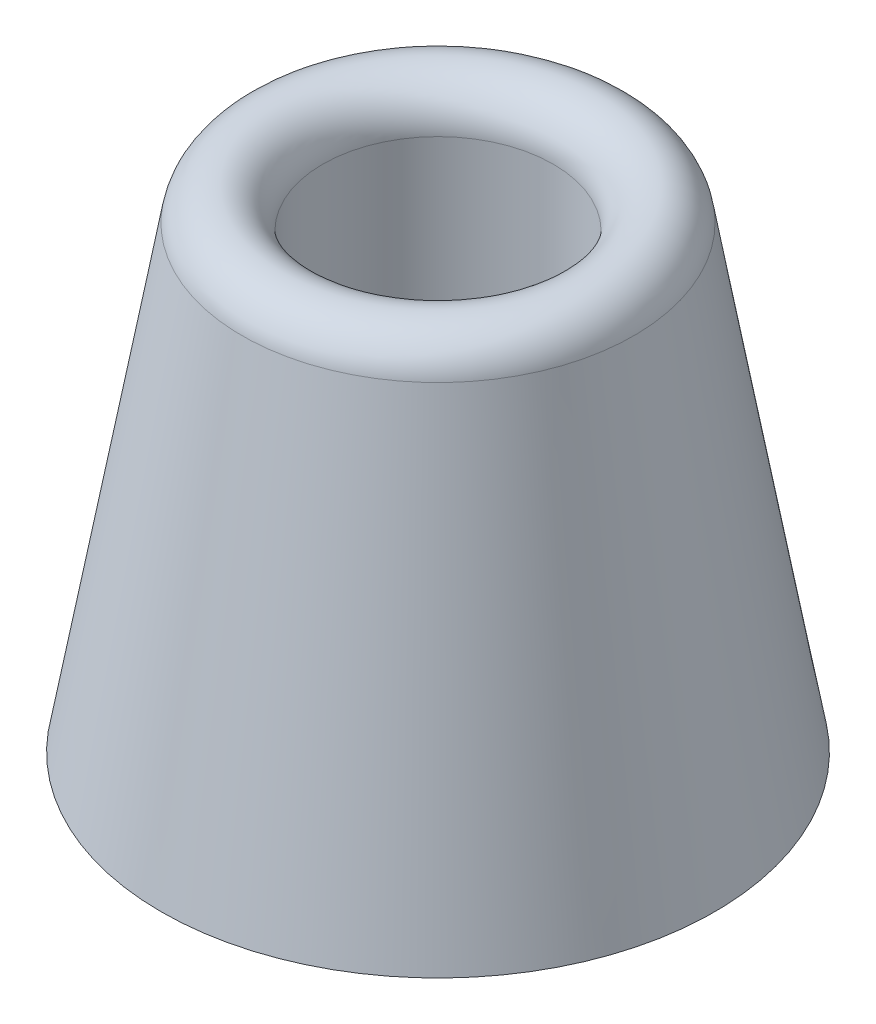
ISO-10303-21;
HEADER;
FILE_DESCRIPTION(('STEP AP214'),'2;1');
FILE_NAME('part.step','',(''),(''),'','','');
FILE_SCHEMA(('AUTOMOTIVE_DESIGN { 1 0 10303 214 1 1 1 1 }'));
ENDSEC;
DATA;
#1=APPLICATION_CONTEXT('core data for automotive mechanical design processes');
#2=APPLICATION_PROTOCOL_DEFINITION('international standard','automotive_design',2000,#1);
#3=PRODUCT_CONTEXT('',#1,'mechanical');
#4=PRODUCT('Part','Part','',(#3));
#5=PRODUCT_RELATED_PRODUCT_CATEGORY('part','',(#4));
#6=PRODUCT_DEFINITION_FORMATION('','',#4);
#7=PRODUCT_DEFINITION_CONTEXT('part definition',#1,'design');
#8=PRODUCT_DEFINITION('design','',#6,#7);
#9=PRODUCT_DEFINITION_SHAPE('','',#8);
#10=(LENGTH_UNIT() NAMED_UNIT(*) SI_UNIT(.MILLI.,.METRE.));
#11=(NAMED_UNIT(*) PLANE_ANGLE_UNIT() SI_UNIT($,.RADIAN.));
#12=(NAMED_UNIT(*) SI_UNIT($,.STERADIAN.) SOLID_ANGLE_UNIT());
#13=UNCERTAINTY_MEASURE_WITH_UNIT(LENGTH_MEASURE(1.E-05),#10,'distance_accuracy_value','');
#14=(GEOMETRIC_REPRESENTATION_CONTEXT(3) GLOBAL_UNCERTAINTY_ASSIGNED_CONTEXT((#13)) GLOBAL_UNIT_ASSIGNED_CONTEXT((#10,
#11,#12)) REPRESENTATION_CONTEXT('',''));
#15=CARTESIAN_POINT('',(0.,0.,0.));
#16=DIRECTION('',(0.,0.,1.));
#17=DIRECTION('',(1.,0.,0.));
#18=AXIS2_PLACEMENT_3D('',#15,#16,#17);
#19=CARTESIAN_POINT('',(0.,0.,0.));
#20=DIRECTION('',(0.,-1.,0.));
#21=DIRECTION('',(0.,0.,-1.));
#22=AXIS2_PLACEMENT_3D('',#19,#20,#21);
#23=CONICAL_SURFACE('',#22,14.2875,0.174532925199434);
#24=CARTESIAN_POINT('',(0.,23.667554611704,0.));
#25=DIRECTION('',(0.,-1.,0.));
#26=DIRECTION('',(0.,0.,-1.));
#27=AXIS2_PLACEMENT_3D('',#24,#25,#26);
#28=CIRCLE('',#27,10.1142715545655);
#29=CARTESIAN_POINT('',(0.,23.667554611704,-10.1142715545655));
#30=VERTEX_POINT('',#29);
#31=EDGE_CURVE('E63',#30,#30,#28,.T.);
#32=ORIENTED_EDGE('',*,*,#31,.T.);
#33=EDGE_LOOP('',(#32));
#34=FACE_BOUND('',#33,.T.);
#35=CARTESIAN_POINT('',(0.,0.,0.));
#36=DIRECTION('',(0.,-1.,0.));
#37=DIRECTION('',(0.,0.,-1.));
#38=AXIS2_PLACEMENT_3D('',#35,#36,#37);
#39=CIRCLE('',#38,14.2875);
#40=CARTESIAN_POINT('',(0.,0.,-14.2875));
#41=VERTEX_POINT('',#40);
#42=EDGE_CURVE('E10',#41,#41,#39,.T.);
#43=ORIENTED_EDGE('',*,*,#42,.F.);
#44=EDGE_LOOP('',(#43));
#45=FACE_BOUND('',#44,.T.);
#46=ADVANCED_FACE('F36',(#34,#45),#23,.T.);
#47=CARTESIAN_POINT('',(14.2875,0.,0.));
#48=DIRECTION('',(0.,-1.,0.));
#49=DIRECTION('',(0.,0.,-1.));
#50=AXIS2_PLACEMENT_3D('',#47,#48,#49);
#51=PLANE('',#50);
#52=ORIENTED_EDGE('',*,*,#42,.T.);
#53=EDGE_LOOP('',(#52));
#54=FACE_BOUND('',#53,.T.);
#55=CARTESIAN_POINT('',(0.,0.,0.));
#56=DIRECTION('',(0.,-1.,0.));
#57=DIRECTION('',(0.,0.,-1.));
#58=AXIS2_PLACEMENT_3D('',#55,#56,#57);
#59=CIRCLE('',#58,3.175);
#60=CARTESIAN_POINT('',(0.,0.,-3.175));
#61=VERTEX_POINT('',#60);
#62=EDGE_CURVE('E43',#61,#61,#59,.T.);
#63=ORIENTED_EDGE('',*,*,#62,.F.);
#64=EDGE_LOOP('',(#63));
#65=FACE_BOUND('',#64,.T.);
#66=ADVANCED_FACE('F82',(#54,#65),#51,.T.);
#67=CARTESIAN_POINT('',(0.,0.,0.));
#68=DIRECTION('',(0.,-1.,0.));
#69=DIRECTION('',(0.,0.,-1.));
#70=AXIS2_PLACEMENT_3D('',#67,#68,#69);
#71=CYLINDRICAL_SURFACE('',#70,3.175);
#72=ORIENTED_EDGE('',*,*,#62,.T.);
#73=EDGE_LOOP('',(#72));
#74=FACE_BOUND('',#73,.T.);
#75=CARTESIAN_POINT('',(0.,13.890625,0.));
#76=DIRECTION('',(0.,-1.,0.));
#77=DIRECTION('',(0.,0.,-1.));
#78=AXIS2_PLACEMENT_3D('',#75,#76,#77);
#79=CIRCLE('',#78,3.175);
#80=CARTESIAN_POINT('',(0.,13.890625,-3.175));
#81=VERTEX_POINT('',#80);
#82=EDGE_CURVE('E49',#81,#81,#79,.T.);
#83=ORIENTED_EDGE('',*,*,#82,.F.);
#84=EDGE_LOOP('',(#83));
#85=FACE_BOUND('',#84,.T.);
#86=ADVANCED_FACE('F86',(#74,#85),#71,.F.);
#87=CARTESIAN_POINT('',(3.175,13.890625,0.));
#88=DIRECTION('',(0.,1.,0.));
#89=DIRECTION('',(0.,0.,1.));
#90=AXIS2_PLACEMENT_3D('',#87,#88,#89);
#91=PLANE('',#90);
#92=ORIENTED_EDGE('',*,*,#82,.T.);
#93=EDGE_LOOP('',(#92));
#94=FACE_BOUND('',#93,.T.);
#95=CARTESIAN_POINT('',(0.,13.890625,0.));
#96=DIRECTION('',(0.,-1.,0.));
#97=DIRECTION('',(0.,0.,-1.));
#98=AXIS2_PLACEMENT_3D('',#95,#96,#97);
#99=CIRCLE('',#98,5.953125);
#100=CARTESIAN_POINT('',(0.,13.890625,-5.953125));
#101=VERTEX_POINT('',#100);
#102=EDGE_CURVE('E54',#101,#101,#99,.T.);
#103=ORIENTED_EDGE('',*,*,#102,.F.);
#104=EDGE_LOOP('',(#103));
#105=FACE_BOUND('',#104,.T.);
#106=ADVANCED_FACE('F78',(#94,#105),#91,.T.);
#107=CARTESIAN_POINT('',(0.,0.,0.));
#108=DIRECTION('',(0.,-1.,0.));
#109=DIRECTION('',(0.,0.,-1.));
#110=AXIS2_PLACEMENT_3D('',#107,#108,#109);
#111=CYLINDRICAL_SURFACE('',#110,5.953125);
#112=ORIENTED_EDGE('',*,*,#102,.T.);
#113=EDGE_LOOP('',(#112));
#114=FACE_BOUND('',#113,.T.);
#115=CARTESIAN_POINT('',(0.,23.3035014609095,0.));
#116=DIRECTION('',(0.,-1.,0.));
#117=DIRECTION('',(0.,0.,-1.));
#118=AXIS2_PLACEMENT_3D('',#115,#116,#117);
#119=CIRCLE('',#118,5.953125);
#120=CARTESIAN_POINT('',(0.,23.3035014609095,-5.953125));
#121=VERTEX_POINT('',#120);
#122=EDGE_CURVE('E60',#121,#121,#119,.T.);
#123=ORIENTED_EDGE('',*,*,#122,.F.);
#124=EDGE_LOOP('',(#123));
#125=FACE_BOUND('',#124,.T.);
#126=ADVANCED_FACE('F72',(#114,#125),#111,.F.);
#127=CARTESIAN_POINT('',(0.,23.3035014609095,0.));
#128=DIRECTION('',(0.,-1.,0.));
#129=DIRECTION('',(0.,0.,-1.));
#130=AXIS2_PLACEMENT_3D('',#127,#128,#129);
#131=TOROIDAL_SURFACE('',#130,8.04962353909046,2.09649853909046);
#132=ORIENTED_EDGE('',*,*,#122,.T.);
#133=EDGE_LOOP('',(#132));
#134=FACE_BOUND('',#133,.T.);
#135=ORIENTED_EDGE('',*,*,#31,.F.);
#136=EDGE_LOOP('',(#135));
#137=FACE_BOUND('',#136,.T.);
#138=ADVANCED_FACE('F70',(#134,#137),#131,.T.);
#139=CLOSED_SHELL('',(#46,#66,#86,#106,#126,#138));
#140=MANIFOLD_SOLID_BREP('B2',#139);
#141=ADVANCED_BREP_SHAPE_REPRESENTATION('',(#18,#140),#14);
#142=SHAPE_DEFINITION_REPRESENTATION(#9,#141);
ENDSEC;
END-ISO-10303-21;
